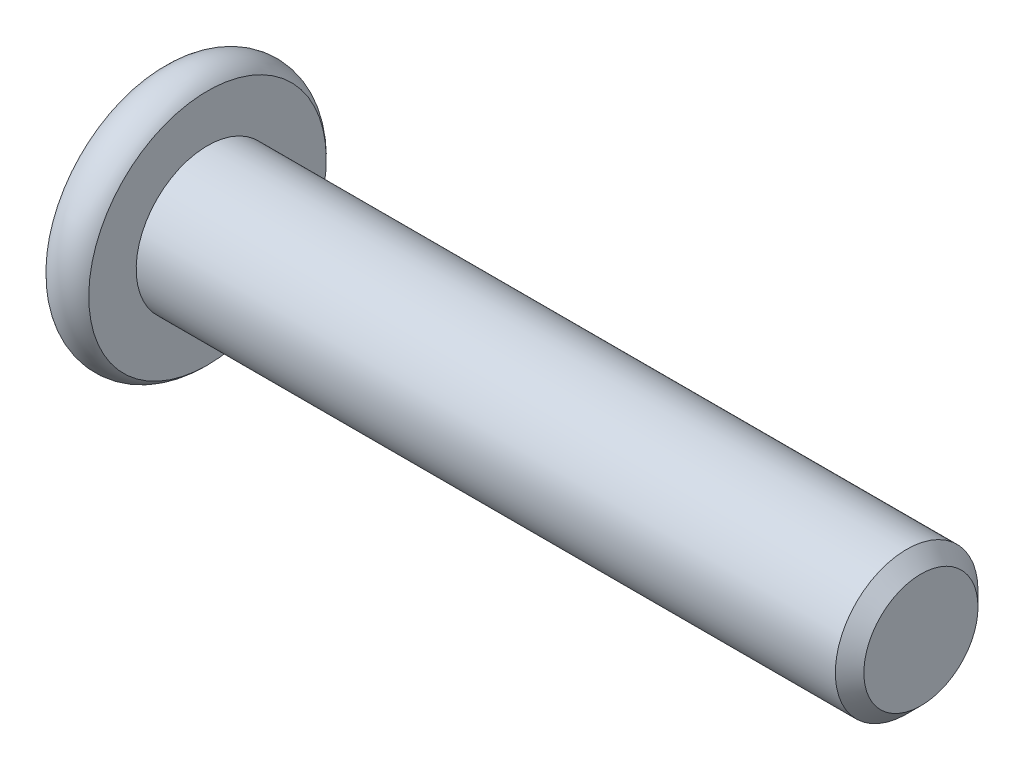
ISO-10303-21;
HEADER;
FILE_DESCRIPTION(('STEP AP214'),'2;1');
FILE_NAME('part.step','',(''),(''),'','','');
FILE_SCHEMA(('AUTOMOTIVE_DESIGN { 1 0 10303 214 1 1 1 1 }'));
ENDSEC;
DATA;
#1=APPLICATION_CONTEXT('core data for automotive mechanical design processes');
#2=APPLICATION_PROTOCOL_DEFINITION('international standard','automotive_design',2000,#1);
#3=PRODUCT_CONTEXT('',#1,'mechanical');
#4=PRODUCT('Part','Part','',(#3));
#5=PRODUCT_RELATED_PRODUCT_CATEGORY('part','',(#4));
#6=PRODUCT_DEFINITION_FORMATION('','',#4);
#7=PRODUCT_DEFINITION_CONTEXT('part definition',#1,'design');
#8=PRODUCT_DEFINITION('design','',#6,#7);
#9=PRODUCT_DEFINITION_SHAPE('','',#8);
#10=(LENGTH_UNIT() NAMED_UNIT(*) SI_UNIT(.MILLI.,.METRE.));
#11=(NAMED_UNIT(*) PLANE_ANGLE_UNIT() SI_UNIT($,.RADIAN.));
#12=(NAMED_UNIT(*) SI_UNIT($,.STERADIAN.) SOLID_ANGLE_UNIT());
#13=UNCERTAINTY_MEASURE_WITH_UNIT(LENGTH_MEASURE(1.E-05),#10,'distance_accuracy_value','');
#14=(GEOMETRIC_REPRESENTATION_CONTEXT(3) GLOBAL_UNCERTAINTY_ASSIGNED_CONTEXT((#13)) GLOBAL_UNIT_ASSIGNED_CONTEXT((#10,
#11,#12)) REPRESENTATION_CONTEXT('',''));
#15=CARTESIAN_POINT('',(0.,0.,0.));
#16=DIRECTION('',(0.,0.,1.));
#17=DIRECTION('',(1.,0.,0.));
#18=AXIS2_PLACEMENT_3D('',#15,#16,#17);
#19=CARTESIAN_POINT('',(-25.,0.,0.));
#20=DIRECTION('',(1.,0.,0.));
#21=DIRECTION('',(0.,0.,-1.));
#22=AXIS2_PLACEMENT_3D('',#19,#20,#21);
#23=CYLINDRICAL_SURFACE('',#22,2.5);
#24=CARTESIAN_POINT('',(-0.500000000000004,0.,0.));
#25=DIRECTION('',(1.,0.,0.));
#26=DIRECTION('',(0.,0.,-1.));
#27=AXIS2_PLACEMENT_3D('',#24,#25,#26);
#28=CIRCLE('',#27,2.5);
#29=CARTESIAN_POINT('',(-0.500000000000004,0.,-2.5));
#30=VERTEX_POINT('',#29);
#31=EDGE_CURVE('E49',#30,#30,#28,.F.);
#32=ORIENTED_EDGE('',*,*,#31,.T.);
#33=EDGE_LOOP('',(#32));
#34=FACE_BOUND('',#33,.T.);
#35=CARTESIAN_POINT('',(-25.,0.,0.));
#36=DIRECTION('',(-1.,0.,0.));
#37=DIRECTION('',(0.,-1.,0.));
#38=AXIS2_PLACEMENT_3D('',#35,#36,#37);
#39=CIRCLE('',#38,2.5);
#40=CARTESIAN_POINT('',(-25.,-2.50000000000001,0.));
#41=VERTEX_POINT('',#40);
#42=EDGE_CURVE('E134',#41,#41,#39,.F.);
#43=ORIENTED_EDGE('',*,*,#42,.T.);
#44=EDGE_LOOP('',(#43));
#45=FACE_BOUND('',#44,.T.);
#46=ADVANCED_FACE('F35',(#34,#45),#23,.T.);
#47=CARTESIAN_POINT('',(0.,0.,0.));
#48=DIRECTION('',(1.,0.,0.));
#49=DIRECTION('',(0.,0.,-1.));
#50=AXIS2_PLACEMENT_3D('',#47,#48,#49);
#51=PLANE('',#50);
#52=CARTESIAN_POINT('',(0.,0.,0.));
#53=DIRECTION('',(1.,0.,0.));
#54=DIRECTION('',(0.,0.,-1.));
#55=AXIS2_PLACEMENT_3D('',#52,#53,#54);
#56=CIRCLE('',#55,1.99999999999999);
#57=CARTESIAN_POINT('',(0.,0.,-1.99999999999999));
#58=VERTEX_POINT('',#57);
#59=EDGE_CURVE('E138',#58,#58,#56,.T.);
#60=ORIENTED_EDGE('',*,*,#59,.T.);
#61=EDGE_LOOP('',(#60));
#62=FACE_BOUND('',#61,.T.);
#63=ADVANCED_FACE('F152',(#62),#51,.T.);
#64=CARTESIAN_POINT('',(0.,0.,0.));
#65=DIRECTION('',(-1.,0.,0.));
#66=DIRECTION('',(0.,0.,1.));
#67=AXIS2_PLACEMENT_3D('',#64,#65,#66);
#68=CONICAL_SURFACE('',#67,1.99999999999999,0.785398163397447);
#69=ORIENTED_EDGE('',*,*,#31,.F.);
#70=EDGE_LOOP('',(#69));
#71=FACE_BOUND('',#70,.T.);
#72=ORIENTED_EDGE('',*,*,#59,.F.);
#73=EDGE_LOOP('',(#72));
#74=FACE_BOUND('',#73,.T.);
#75=ADVANCED_FACE('F37',(#71,#74),#68,.T.);
#76=CARTESIAN_POINT('',(-26.5,0.,0.));
#77=DIRECTION('',(1.,0.,0.));
#78=DIRECTION('',(0.,1.,0.));
#79=AXIS2_PLACEMENT_3D('',#76,#77,#78);
#80=PLANE('',#79);
#81=CARTESIAN_POINT('',(-26.5,1.01169842360595E-13,0.));
#82=DIRECTION('',(-1.,0.,0.));
#83=DIRECTION('',(0.,-1.,0.));
#84=AXIS2_PLACEMENT_3D('',#81,#82,#83);
#85=CIRCLE('',#84,1.78205080756885);
#86=CARTESIAN_POINT('',(-26.5,-1.78205080756875,0.));
#87=VERTEX_POINT('',#86);
#88=EDGE_CURVE('E374',#87,#87,#85,.T.);
#89=ORIENTED_EDGE('',*,*,#88,.F.);
#90=EDGE_LOOP('',(#89));
#91=FACE_BOUND('',#90,.T.);
#92=CARTESIAN_POINT('',(-26.5,0.,0.));
#93=DIRECTION('',(-1.,0.,0.));
#94=DIRECTION('',(0.,-1.,0.));
#95=AXIS2_PLACEMENT_3D('',#92,#93,#94);
#96=CIRCLE('',#95,4.16143782776614);
#97=CARTESIAN_POINT('',(-26.5,-4.16143782776615,0.));
#98=VERTEX_POINT('',#97);
#99=EDGE_CURVE('E130',#98,#98,#96,.T.);
#100=ORIENTED_EDGE('',*,*,#99,.T.);
#101=EDGE_LOOP('',(#100));
#102=FACE_BOUND('',#101,.T.);
#103=ADVANCED_FACE('F151',(#91,#102),#80,.F.);
#104=CARTESIAN_POINT('',(-25.75,0.,0.));
#105=DIRECTION('',(-1.,0.,0.));
#106=DIRECTION('',(0.,-1.,0.));
#107=AXIS2_PLACEMENT_3D('',#104,#105,#106);
#108=TOROIDAL_SURFACE('',#107,3.5,1.);
#109=ORIENTED_EDGE('',*,*,#99,.F.);
#110=EDGE_LOOP('',(#109));
#111=FACE_BOUND('',#110,.T.);
#112=CARTESIAN_POINT('',(-25.,0.,0.));
#113=DIRECTION('',(-1.,0.,0.));
#114=DIRECTION('',(0.,-1.,0.));
#115=AXIS2_PLACEMENT_3D('',#112,#113,#114);
#116=CIRCLE('',#115,4.16143782776614);
#117=CARTESIAN_POINT('',(-25.,-4.16143782776615,0.));
#118=VERTEX_POINT('',#117);
#119=EDGE_CURVE('E126',#118,#118,#116,.T.);
#120=ORIENTED_EDGE('',*,*,#119,.T.);
#121=EDGE_LOOP('',(#120));
#122=FACE_BOUND('',#121,.T.);
#123=ADVANCED_FACE('F163',(#111,#122),#108,.T.);
#124=CARTESIAN_POINT('',(-25.,4.16143782776614,0.));
#125=DIRECTION('',(-1.,0.,0.));
#126=DIRECTION('',(0.,-1.,0.));
#127=AXIS2_PLACEMENT_3D('',#124,#125,#126);
#128=PLANE('',#127);
#129=ORIENTED_EDGE('',*,*,#42,.F.);
#130=EDGE_LOOP('',(#129));
#131=FACE_BOUND('',#130,.T.);
#132=ORIENTED_EDGE('',*,*,#119,.F.);
#133=EDGE_LOOP('',(#132));
#134=FACE_BOUND('',#133,.T.);
#135=ADVANCED_FACE('F167',(#131,#134),#128,.F.);
#136=CARTESIAN_POINT('',(-26.5,1.01169842360595E-13,0.));
#137=DIRECTION('',(-1.,0.,0.));
#138=DIRECTION('',(0.,-1.,0.));
#139=AXIS2_PLACEMENT_3D('',#136,#137,#138);
#140=CONICAL_SURFACE('',#139,1.78205080756885,0.78539816339745);
#141=ORIENTED_EDGE('',*,*,#88,.T.);
#142=EDGE_LOOP('',(#141));
#143=FACE_BOUND('',#142,.T.);
#144=CARTESIAN_POINT('',(-27.015428085613,-1.74023253176571,1.5));
#145=CARTESIAN_POINT('',(-26.9833811073445,-1.69791724929724,1.5));
#146=CARTESIAN_POINT('',(-26.9516444672841,-1.65536760966785,1.5));
#147=CARTESIAN_POINT('',(-26.8889203936153,-1.56970398156678,1.5));
#148=CARTESIAN_POINT('',(-26.85793314822,-1.52658985542842,1.5));
#149=CARTESIAN_POINT('',(-26.765846164345,-1.39562626326557,1.5));
#150=CARTESIAN_POINT('',(-26.7061145123021,-1.30679868010569,1.5));
#151=CARTESIAN_POINT('',(-26.5887342891013,-1.12044622640208,1.5));
#152=CARTESIAN_POINT('',(-26.5314082774823,-1.02271587306666,1.5));
#153=CARTESIAN_POINT('',(-26.426463214976,-0.822357214965194,1.5));
#154=CARTESIAN_POINT('',(-26.3788114236896,-0.719746931701858,1.5));
#155=CARTESIAN_POINT('',(-26.3205099883151,-0.565852387095032,1.5));
#156=CARTESIAN_POINT('',(-26.3037990535409,-0.51687419142462,1.5));
#157=CARTESIAN_POINT('',(-26.2743077515089,-0.417723988457459,1.5));
#158=CARTESIAN_POINT('',(-26.2615276514219,-0.367551900263826,1.5));
#159=CARTESIAN_POINT('',(-26.2407784202458,-0.267158299056077,1.5));
#160=CARTESIAN_POINT('',(-26.232726061826,-0.216954261864813,1.5));
#161=CARTESIAN_POINT('',(-26.221591636834,-0.115994915871279,1.5));
#162=CARTESIAN_POINT('',(-26.2185086886377,-0.0652397064614969,1.5));
#163=CARTESIAN_POINT('',(-26.2175473897404,0.034422223487599,1.5));
#164=CARTESIAN_POINT('',(-26.2194789216952,0.0833271701101331,1.5));
#165=CARTESIAN_POINT('',(-26.2280175729677,0.180724293127266,1.5));
#166=CARTESIAN_POINT('',(-26.234625142048,0.229216429361773,1.5));
#167=CARTESIAN_POINT('',(-26.2522650626447,0.326258027697052,1.5));
#168=CARTESIAN_POINT('',(-26.263373168201,0.374793507450073,1.5));
#169=CARTESIAN_POINT('',(-26.2894198669595,0.470802295834227,1.5));
#170=CARTESIAN_POINT('',(-26.3043581560035,0.51827568848133,1.5));
#171=CARTESIAN_POINT('',(-26.356839545716,0.667150562065179,1.5));
#172=CARTESIAN_POINT('',(-26.4003351165442,0.766448362426898,1.5));
#173=CARTESIAN_POINT('',(-26.4970587814836,0.960384405673885,1.5));
#174=CARTESIAN_POINT('',(-26.5503217226675,1.05500437383626,1.5));
#175=CARTESIAN_POINT('',(-26.6602258010454,1.23584520321537,1.5));
#176=CARTESIAN_POINT('',(-26.7165682531046,1.32224986946555,1.5));
#177=CARTESIAN_POINT('',(-26.803675572597,1.44954953726478,1.5));
#178=CARTESIAN_POINT('',(-26.8330199906839,1.49143368482428,1.5));
#179=CARTESIAN_POINT('',(-26.8924869182931,1.57462914783249,1.5));
#180=CARTESIAN_POINT('',(-26.9226092115007,1.61594061772584,1.5));
#181=CARTESIAN_POINT('',(-26.9530541181366,1.65701358742558,1.5));
#182=B_SPLINE_CURVE_WITH_KNOTS('',3,(#144,#145,#146,#147,#148,#149,#150,#151,#152,#153,#154,
#155,#156,#157,#158,#159,#160,#161,#162,#163,#164,#165,#166,#167,#168,#169,#170,#171,#172,#173,
#174,#175,#176,#177,#178,#179,#180,#181),.UNSPECIFIED.,.F.,.F.,(4,2,2,2,2,2,2,2,2,2,2,2,2,2,2,2,
2,2,4),(0.,0.159238974218355,0.318517535014544,0.639504781932387,0.979137893799194,
1.31760168934356,1.47272233841623,1.62785352839775,1.78016486537346,1.93244917778278,
2.07904486260297,2.22565464958331,2.37484213303398,2.52401777304039,2.84828365283774,
3.17372975666749,3.48303030530536,3.63644667013907,3.78982082222911),.UNSPECIFIED.);
#183=CARTESIAN_POINT('',(-26.45,-0.866025403784338,1.5));
#184=VERTEX_POINT('',#183);
#185=CARTESIAN_POINT('',(-26.45,0.86602540378454,1.5));
#186=VERTEX_POINT('',#185);
#187=EDGE_CURVE('E104',#184,#186,#182,.T.);
#188=ORIENTED_EDGE('',*,*,#187,.F.);
#189=CARTESIAN_POINT('',(-26.4501154816001,-1.73216627762261,-0.000200000000000525));
#190=CARTESIAN_POINT('',(-26.4203654760674,-1.70239359975905,0.0513677907370755));
#191=CARTESIAN_POINT('',(-26.3923624839104,-1.67212305186345,0.103797917665201));
#192=CARTESIAN_POINT('',(-26.3410892304402,-1.61039789003609,0.210709034055597));
#193=CARTESIAN_POINT('',(-26.3178475050444,-1.57893740312604,0.265200195814661));
#194=CARTESIAN_POINT('',(-26.2780337289923,-1.51549879897977,0.375079081357248));
#195=CARTESIAN_POINT('',(-26.2613615856709,-1.483536845268,0.430438809095199));
#196=CARTESIAN_POINT('',(-26.2356744568181,-1.41890915196201,0.54237725747715));
#197=CARTESIAN_POINT('',(-26.2266402904789,-1.38624538781108,0.598952556553008));
#198=CARTESIAN_POINT('',(-26.2184890812269,-1.32995210095289,0.69645538951644));
#199=CARTESIAN_POINT('',(-26.2172822529893,-1.30639533311114,0.737256908280466));
#200=CARTESIAN_POINT('',(-26.2193140571623,-1.25932335290183,0.818787969615858));
#201=CARTESIAN_POINT('',(-26.2225536707483,-1.23580815085303,0.859517494314629));
#202=CARTESIAN_POINT('',(-26.233291985982,-1.18900414978417,0.940584402163415));
#203=CARTESIAN_POINT('',(-26.2407946530188,-1.1657155821171,0.980921384598287));
#204=CARTESIAN_POINT('',(-26.2596516119283,-1.11952932016325,1.06091833691403));
#205=CARTESIAN_POINT('',(-26.2710075570186,-1.09663179808776,1.10057800851621));
#206=CARTESIAN_POINT('',(-26.3047216475927,-1.03798159809688,1.20216313477448));
#207=CARTESIAN_POINT('',(-26.3296218490934,-1.00259267147455,1.26345855370969));
#208=CARTESIAN_POINT('',(-26.3716566532716,-0.950557780604275,1.35358562846331));
#209=CARTESIAN_POINT('',(-26.3864251535591,-0.933410759677048,1.38328513990772));
#210=CARTESIAN_POINT('',(-26.4173105659402,-0.899432101996308,1.44213790138375));
#211=CARTESIAN_POINT('',(-26.4334268341217,-0.88260031928561,1.47129140422064));
#212=CARTESIAN_POINT('',(-26.4501154816001,-0.865909933730501,1.5002));
#213=B_SPLINE_CURVE_WITH_KNOTS('',3,(#189,#190,#191,#192,#193,#194,#195,#196,#197,#198,#199,
#200,#201,#202,#203,#204,#205,#206,#207,#208,#209,#210,#211,#212),.UNSPECIFIED.,.F.,.F.,(4,2,2,
2,2,2,2,2,2,2,2,4),(0.,0.199829143693305,0.400822987382387,0.59862372053818,0.795926240188888,
0.93711306795988,1.07833105577193,1.21968061668222,1.36109089931054,1.58570969637565,
1.69770705470963,1.80965120737193),.UNSPECIFIED.);
#214=CARTESIAN_POINT('',(-26.45,-1.73205080756878,0.));
#215=VERTEX_POINT('',#214);
#216=EDGE_CURVE('E209',#215,#184,#213,.T.);
#217=ORIENTED_EDGE('',*,*,#216,.F.);
#218=CARTESIAN_POINT('',(-26.4501154816001,-0.865909933730499,-1.5002));
#219=CARTESIAN_POINT('',(-26.4203654760674,-0.895682611594064,-1.44863220926293));
#220=CARTESIAN_POINT('',(-26.3923624839103,-0.925953159489663,-1.3962020823348));
#221=CARTESIAN_POINT('',(-26.3410892304402,-0.987678321317022,-1.2892909659444));
#222=CARTESIAN_POINT('',(-26.3178475050444,-1.01913880822707,-1.23479980418534));
#223=CARTESIAN_POINT('',(-26.2780337289923,-1.08257741237334,-1.12492091864275));
#224=CARTESIAN_POINT('',(-26.2613615856709,-1.11453936608511,-1.0695611909048));
#225=CARTESIAN_POINT('',(-26.2356744568181,-1.1791670593911,-0.957622742522849));
#226=CARTESIAN_POINT('',(-26.2266402904789,-1.21183082354203,-0.90104744344699));
#227=CARTESIAN_POINT('',(-26.2184890812269,-1.26812411040022,-0.803544610483558));
#228=CARTESIAN_POINT('',(-26.2172822529893,-1.29168087824198,-0.762743091719532));
#229=CARTESIAN_POINT('',(-26.2193140571623,-1.33875285845128,-0.68121203038414));
#230=CARTESIAN_POINT('',(-26.2225536707483,-1.36226806050008,-0.640482505685369));
#231=CARTESIAN_POINT('',(-26.233291985982,-1.40907206156895,-0.559415597836583));
#232=CARTESIAN_POINT('',(-26.2407946530188,-1.43236062923602,-0.519078615401711));
#233=CARTESIAN_POINT('',(-26.2596516119283,-1.47854689118986,-0.439081663085968));
#234=CARTESIAN_POINT('',(-26.2710075570186,-1.50144441326535,-0.39942199148379));
#235=CARTESIAN_POINT('',(-26.3047216475927,-1.56009461325623,-0.297836865225514));
#236=CARTESIAN_POINT('',(-26.3296218490934,-1.59548353987856,-0.23654144629031));
#237=CARTESIAN_POINT('',(-26.3716566532716,-1.64751843074884,-0.146414371536687));
#238=CARTESIAN_POINT('',(-26.3864251535591,-1.66466545167607,-0.116714860092283));
#239=CARTESIAN_POINT('',(-26.4173105659402,-1.69864410935681,-0.0578620986162499));
#240=CARTESIAN_POINT('',(-26.4334268341217,-1.7154758920675,-0.0287085957793639));
#241=CARTESIAN_POINT('',(-26.4501154816001,-1.73216627762261,0.000199999999998611));
#242=B_SPLINE_CURVE_WITH_KNOTS('',3,(#218,#219,#220,#221,#222,#223,#224,#225,#226,#227,#228,
#229,#230,#231,#232,#233,#234,#235,#236,#237,#238,#239,#240,#241),.UNSPECIFIED.,.F.,.F.,(4,2,2,
2,2,2,2,2,2,2,2,4),(0.,0.199829143693305,0.40082298738239,0.598623720538183,0.795926240188893,
0.937113067959885,1.07833105577193,1.21968061668222,1.36109089931055,1.58570969637566,
1.69770705470964,1.80965120737194),.UNSPECIFIED.);
#243=CARTESIAN_POINT('',(-26.45,-0.866025403784338,-1.5));
#244=VERTEX_POINT('',#243);
#245=EDGE_CURVE('E204',#244,#215,#242,.T.);
#246=ORIENTED_EDGE('',*,*,#245,.F.);
#247=CARTESIAN_POINT('',(-27.015428085613,-1.7402325317657,-1.5));
#248=CARTESIAN_POINT('',(-26.9833811073445,-1.69791724929724,-1.5));
#249=CARTESIAN_POINT('',(-26.9516444672841,-1.65536760966785,-1.5));
#250=CARTESIAN_POINT('',(-26.8889203936153,-1.56970398156678,-1.5));
#251=CARTESIAN_POINT('',(-26.85793314822,-1.52658985542842,-1.5));
#252=CARTESIAN_POINT('',(-26.765846164345,-1.39562626326556,-1.5));
#253=CARTESIAN_POINT('',(-26.7061145123021,-1.30679868010569,-1.5));
#254=CARTESIAN_POINT('',(-26.5887342891013,-1.12044622640208,-1.5));
#255=CARTESIAN_POINT('',(-26.5314082774823,-1.02271587306666,-1.5));
#256=CARTESIAN_POINT('',(-26.426463214976,-0.822357214965194,-1.5));
#257=CARTESIAN_POINT('',(-26.3788114236896,-0.719746931701856,-1.5));
#258=CARTESIAN_POINT('',(-26.3205099883151,-0.56585238709503,-1.5));
#259=CARTESIAN_POINT('',(-26.3037990535409,-0.516874191424619,-1.5));
#260=CARTESIAN_POINT('',(-26.2743077515089,-0.417723988457458,-1.5));
#261=CARTESIAN_POINT('',(-26.2615276514219,-0.367551900263825,-1.5));
#262=CARTESIAN_POINT('',(-26.2407784202458,-0.267158299056076,-1.5));
#263=CARTESIAN_POINT('',(-26.232726061826,-0.216954261864812,-1.5));
#264=CARTESIAN_POINT('',(-26.221591636834,-0.115994915871278,-1.5));
#265=CARTESIAN_POINT('',(-26.2185086886377,-0.0652397064614956,-1.5));
#266=CARTESIAN_POINT('',(-26.2175473897404,0.0344222234876,-1.5));
#267=CARTESIAN_POINT('',(-26.2194789216952,0.083327170110134,-1.5));
#268=CARTESIAN_POINT('',(-26.2280175729677,0.180724293127267,-1.5));
#269=CARTESIAN_POINT('',(-26.234625142048,0.229216429361774,-1.5));
#270=CARTESIAN_POINT('',(-26.2522650626447,0.326258027697053,-1.5));
#271=CARTESIAN_POINT('',(-26.263373168201,0.374793507450073,-1.5));
#272=CARTESIAN_POINT('',(-26.2894198669595,0.470802295834227,-1.5));
#273=CARTESIAN_POINT('',(-26.3043581560035,0.51827568848133,-1.5));
#274=CARTESIAN_POINT('',(-26.356839545716,0.66715056206518,-1.5));
#275=CARTESIAN_POINT('',(-26.4003351165442,0.766448362426899,-1.5));
#276=CARTESIAN_POINT('',(-26.4970587814836,0.960384405673885,-1.5));
#277=CARTESIAN_POINT('',(-26.5503217226675,1.05500437383626,-1.5));
#278=CARTESIAN_POINT('',(-26.6602258010454,1.23584520321537,-1.5));
#279=CARTESIAN_POINT('',(-26.7165682531046,1.32224986946555,-1.5));
#280=CARTESIAN_POINT('',(-26.803675572597,1.44954953726478,-1.5));
#281=CARTESIAN_POINT('',(-26.8330199906839,1.49143368482428,-1.5));
#282=CARTESIAN_POINT('',(-26.8924869182931,1.57462914783249,-1.5));
#283=CARTESIAN_POINT('',(-26.9226092115007,1.61594061772585,-1.5));
#284=CARTESIAN_POINT('',(-26.9530541181366,1.65701358742558,-1.5));
#285=B_SPLINE_CURVE_WITH_KNOTS('',3,(#247,#248,#249,#250,#251,#252,#253,#254,#255,#256,#257,
#258,#259,#260,#261,#262,#263,#264,#265,#266,#267,#268,#269,#270,#271,#272,#273,#274,#275,#276,
#277,#278,#279,#280,#281,#282,#283,#284),.UNSPECIFIED.,.F.,.F.,(4,2,2,2,2,2,2,2,2,2,2,2,2,2,2,2,
2,2,4),(0.,0.159238974218352,0.318517535014541,0.639504781932383,0.979137893799189,
1.31760168934356,1.47272233841623,1.62785352839774,1.78016486537345,1.93244917778278,
2.07904486260296,2.22565464958331,2.37484213303397,2.52401777304038,2.84828365283774,
3.17372975666748,3.48303030530535,3.63644667013907,3.78982082222911),.UNSPECIFIED.);
#286=CARTESIAN_POINT('',(-26.45,0.86602540378454,-1.5));
#287=VERTEX_POINT('',#286);
#288=EDGE_CURVE('E56',#287,#244,#285,.F.);
#289=ORIENTED_EDGE('',*,*,#288,.F.);
#290=CARTESIAN_POINT('',(-26.4501154816001,1.73216627762282,0.000200000000000487));
#291=CARTESIAN_POINT('',(-26.4203654760674,1.70239359975925,-0.0513677907370748));
#292=CARTESIAN_POINT('',(-26.3923624839103,1.67212305186365,-0.1037979176652));
#293=CARTESIAN_POINT('',(-26.3410892304402,1.61039789003629,-0.210709034055595));
#294=CARTESIAN_POINT('',(-26.3178475050444,1.57893740312624,-0.26520019581466));
#295=CARTESIAN_POINT('',(-26.2780337289922,1.51549879897997,-0.375079081357248));
#296=CARTESIAN_POINT('',(-26.2613615856709,1.4835368452682,-0.4304388090952));
#297=CARTESIAN_POINT('',(-26.2356744568181,1.41890915196221,-0.542377257477151));
#298=CARTESIAN_POINT('',(-26.2266402904789,1.38624538781128,-0.598952556553009));
#299=CARTESIAN_POINT('',(-26.2184890812269,1.3299521009531,-0.696455389516441));
#300=CARTESIAN_POINT('',(-26.2172822529892,1.30639533311134,-0.737256908280466));
#301=CARTESIAN_POINT('',(-26.2193140571623,1.25932335290203,-0.818787969615858));
#302=CARTESIAN_POINT('',(-26.2225536707483,1.23580815085323,-0.85951749431463));
#303=CARTESIAN_POINT('',(-26.233291985982,1.18900414978437,-0.940584402163416));
#304=CARTESIAN_POINT('',(-26.2407946530188,1.1657155821173,-0.980921384598289));
#305=CARTESIAN_POINT('',(-26.2596516119283,1.11952932016345,-1.06091833691403));
#306=CARTESIAN_POINT('',(-26.2710075570186,1.09663179808796,-1.10057800851621));
#307=CARTESIAN_POINT('',(-26.3047216475927,1.03798159809708,-1.20216313477449));
#308=CARTESIAN_POINT('',(-26.3296218490934,1.00259267147475,-1.26345855370969));
#309=CARTESIAN_POINT('',(-26.3716566532716,0.950557780604475,-1.35358562846331));
#310=CARTESIAN_POINT('',(-26.3864251535591,0.933410759677248,-1.38328513990772));
#311=CARTESIAN_POINT('',(-26.4173105659402,0.899432101996507,-1.44213790138375));
#312=CARTESIAN_POINT('',(-26.4334268341217,0.882600319285811,-1.47129140422064));
#313=CARTESIAN_POINT('',(-26.4501154816001,0.865909933730702,-1.5002));
#314=B_SPLINE_CURVE_WITH_KNOTS('',3,(#290,#291,#292,#293,#294,#295,#296,#297,#298,#299,#300,
#301,#302,#303,#304,#305,#306,#307,#308,#309,#310,#311,#312,#313),.UNSPECIFIED.,.F.,.F.,(4,2,2,
2,2,2,2,2,2,2,2,4),(0.,0.199829143693305,0.400822987382389,0.598623720538183,0.79592624018889,
0.937113067959883,1.07833105577193,1.21968061668222,1.36109089931055,1.58570969637566,
1.69770705470964,1.80965120737194),.UNSPECIFIED.);
#315=CARTESIAN_POINT('',(-26.45,1.73205080756898,0.));
#316=VERTEX_POINT('',#315);
#317=EDGE_CURVE('E11',#316,#287,#314,.T.);
#318=ORIENTED_EDGE('',*,*,#317,.F.);
#319=CARTESIAN_POINT('',(-26.4501154816001,0.865909933730702,1.5002));
#320=CARTESIAN_POINT('',(-26.4203654760674,0.895682611594268,1.44863220926292));
#321=CARTESIAN_POINT('',(-26.3923624839103,0.925953159489867,1.3962020823348));
#322=CARTESIAN_POINT('',(-26.3410892304402,0.987678321317225,1.2892909659444));
#323=CARTESIAN_POINT('',(-26.3178475050444,1.01913880822728,1.23479980418534));
#324=CARTESIAN_POINT('',(-26.2780337289922,1.08257741237354,1.12492091864275));
#325=CARTESIAN_POINT('',(-26.2613615856709,1.11453936608531,1.0695611909048));
#326=CARTESIAN_POINT('',(-26.2356744568181,1.1791670593913,0.95762274252285));
#327=CARTESIAN_POINT('',(-26.2266402904789,1.21183082354223,0.901047443446992));
#328=CARTESIAN_POINT('',(-26.2184890812269,1.26812411040042,0.80354461048356));
#329=CARTESIAN_POINT('',(-26.2172822529892,1.29168087824218,0.762743091719535));
#330=CARTESIAN_POINT('',(-26.2193140571623,1.33875285845148,0.681212030384143));
#331=CARTESIAN_POINT('',(-26.2225536707483,1.36226806050028,0.640482505685371));
#332=CARTESIAN_POINT('',(-26.233291985982,1.40907206156915,0.559415597836585));
#333=CARTESIAN_POINT('',(-26.2407946530188,1.43236062923622,0.519078615401713));
#334=CARTESIAN_POINT('',(-26.2596516119283,1.47854689119006,0.43908166308597));
#335=CARTESIAN_POINT('',(-26.2710075570186,1.50144441326555,0.399421991483793));
#336=CARTESIAN_POINT('',(-26.3047216475927,1.56009461325643,0.297836865225516));
#337=CARTESIAN_POINT('',(-26.3296218490934,1.59548353987876,0.236541446290312));
#338=CARTESIAN_POINT('',(-26.3716566532716,1.64751843074904,0.146414371536687));
#339=CARTESIAN_POINT('',(-26.3864251535591,1.66466545167627,0.116714860092283));
#340=CARTESIAN_POINT('',(-26.4173105659402,1.69864410935701,0.0578620986162496));
#341=CARTESIAN_POINT('',(-26.4334268341217,1.71547589206771,0.0287085957793628));
#342=CARTESIAN_POINT('',(-26.4501154816001,1.73216627762282,-0.000200000000000406));
#343=B_SPLINE_CURVE_WITH_KNOTS('',3,(#319,#320,#321,#322,#323,#324,#325,#326,#327,#328,#329,
#330,#331,#332,#333,#334,#335,#336,#337,#338,#339,#340,#341,#342),.UNSPECIFIED.,.F.,.F.,(4,2,2,
2,2,2,2,2,2,2,2,4),(0.,0.199829143693304,0.400822987382387,0.598623720538178,0.795926240188886,
0.937113067959877,1.07833105577192,1.21968061668222,1.36109089931054,1.58570969637565,
1.69770705470963,1.80965120737194),.UNSPECIFIED.);
#344=EDGE_CURVE('E94',#186,#316,#343,.T.);
#345=ORIENTED_EDGE('',*,*,#344,.F.);
#346=EDGE_LOOP('',(#188,#217,#246,#289,#318,#345));
#347=FACE_BOUND('',#346,.T.);
#348=ADVANCED_FACE('F93',(#143,#347),#140,.F.);
#349=CARTESIAN_POINT('',(-24.2,0.,0.));
#350=DIRECTION('',(-1.,0.,0.));
#351=DIRECTION('',(0.,-1.,0.));
#352=AXIS2_PLACEMENT_3D('',#349,#350,#351);
#353=PLANE('',#352);
#354=DIRECTION('',(0.,0.5,-0.866025403784439));
#355=VECTOR('',#354,1.);
#356=CARTESIAN_POINT('',(-24.2,0.866025403784531,1.5));
#357=LINE('',#356,#355);
#358=CARTESIAN_POINT('',(-24.2,0.866025403784531,1.5));
#359=VERTEX_POINT('',#358);
#360=CARTESIAN_POINT('',(-24.2,1.73205080756897,0.));
#361=VERTEX_POINT('',#360);
#362=EDGE_CURVE('E103',#359,#361,#357,.T.);
#363=ORIENTED_EDGE('',*,*,#362,.T.);
#364=DIRECTION('',(0.,-0.5,-0.866025403784439));
#365=VECTOR('',#364,1.);
#366=CARTESIAN_POINT('',(-24.2,1.73205080756897,0.));
#367=LINE('',#366,#365);
#368=CARTESIAN_POINT('',(-24.2,0.866025403784531,-1.5));
#369=VERTEX_POINT('',#368);
#370=EDGE_CURVE('E108',#361,#369,#367,.T.);
#371=ORIENTED_EDGE('',*,*,#370,.T.);
#372=DIRECTION('',(0.,-1.,0.));
#373=VECTOR('',#372,1.);
#374=CARTESIAN_POINT('',(-24.2,0.866025403784531,-1.5));
#375=LINE('',#374,#373);
#376=CARTESIAN_POINT('',(-24.2,-0.866025403784346,-1.5));
#377=VERTEX_POINT('',#376);
#378=EDGE_CURVE('E235',#369,#377,#375,.T.);
#379=ORIENTED_EDGE('',*,*,#378,.T.);
#380=DIRECTION('',(0.,-0.5,0.866025403784438));
#381=VECTOR('',#380,1.);
#382=CARTESIAN_POINT('',(-24.2,-0.866025403784346,-1.5));
#383=LINE('',#382,#381);
#384=CARTESIAN_POINT('',(-24.2,-1.73205080756878,0.));
#385=VERTEX_POINT('',#384);
#386=EDGE_CURVE('E240',#377,#385,#383,.T.);
#387=ORIENTED_EDGE('',*,*,#386,.T.);
#388=DIRECTION('',(0.,0.5,0.866025403784439));
#389=VECTOR('',#388,1.);
#390=CARTESIAN_POINT('',(-24.2,-1.73205080756878,0.));
#391=LINE('',#390,#389);
#392=CARTESIAN_POINT('',(-24.2,-0.866025403784347,1.5));
#393=VERTEX_POINT('',#392);
#394=EDGE_CURVE('E122',#385,#393,#391,.T.);
#395=ORIENTED_EDGE('',*,*,#394,.T.);
#396=DIRECTION('',(0.,1.,0.));
#397=VECTOR('',#396,1.);
#398=CARTESIAN_POINT('',(-24.2,-0.866025403784347,1.5));
#399=LINE('',#398,#397);
#400=EDGE_CURVE('E112',#393,#359,#399,.T.);
#401=ORIENTED_EDGE('',*,*,#400,.T.);
#402=EDGE_LOOP('',(#363,#371,#379,#387,#395,#401));
#403=FACE_BOUND('',#402,.T.);
#404=ADVANCED_FACE('F191',(#403),#353,.T.);
#405=CARTESIAN_POINT('',(-24.2,1.73205080756897,0.));
#406=DIRECTION('',(0.,0.866025403784439,-0.5));
#407=DIRECTION('',(0.,0.5,0.866025403784439));
#408=AXIS2_PLACEMENT_3D('',#405,#406,#407);
#409=PLANE('',#408);
#410=DIRECTION('',(-1.,0.,0.));
#411=VECTOR('',#410,1.);
#412=CARTESIAN_POINT('',(-24.2,1.73205080756897,0.));
#413=LINE('',#412,#411);
#414=EDGE_CURVE('E100',#361,#316,#413,.T.);
#415=ORIENTED_EDGE('',*,*,#414,.T.);
#416=ORIENTED_EDGE('',*,*,#317,.T.);
#417=DIRECTION('',(-1.,0.,0.));
#418=VECTOR('',#417,1.);
#419=CARTESIAN_POINT('',(-24.2,0.866025403784531,-1.5));
#420=LINE('',#419,#418);
#421=EDGE_CURVE('E111',#369,#287,#420,.T.);
#422=ORIENTED_EDGE('',*,*,#421,.F.);
#423=ORIENTED_EDGE('',*,*,#370,.F.);
#424=EDGE_LOOP('',(#415,#416,#422,#423));
#425=FACE_BOUND('',#424,.T.);
#426=ADVANCED_FACE('F106',(#425),#409,.F.);
#427=CARTESIAN_POINT('',(-24.2,0.866025403784531,-1.5));
#428=DIRECTION('',(0.,0.,-1.));
#429=DIRECTION('',(-1.,0.,0.));
#430=AXIS2_PLACEMENT_3D('',#427,#428,#429);
#431=PLANE('',#430);
#432=ORIENTED_EDGE('',*,*,#421,.T.);
#433=ORIENTED_EDGE('',*,*,#288,.T.);
#434=DIRECTION('',(-1.,0.,0.));
#435=VECTOR('',#434,1.);
#436=CARTESIAN_POINT('',(-24.2,-0.866025403784346,-1.5));
#437=LINE('',#436,#435);
#438=EDGE_CURVE('E118',#377,#244,#437,.T.);
#439=ORIENTED_EDGE('',*,*,#438,.F.);
#440=ORIENTED_EDGE('',*,*,#378,.F.);
#441=EDGE_LOOP('',(#432,#433,#439,#440));
#442=FACE_BOUND('',#441,.T.);
#443=ADVANCED_FACE('F224',(#442),#431,.F.);
#444=CARTESIAN_POINT('',(-24.2,-0.866025403784346,-1.5));
#445=DIRECTION('',(0.,-0.866025403784439,-0.5));
#446=DIRECTION('',(0.,0.5,-0.866025403784439));
#447=AXIS2_PLACEMENT_3D('',#444,#445,#446);
#448=PLANE('',#447);
#449=ORIENTED_EDGE('',*,*,#438,.T.);
#450=ORIENTED_EDGE('',*,*,#245,.T.);
#451=DIRECTION('',(-1.,0.,0.));
#452=VECTOR('',#451,1.);
#453=CARTESIAN_POINT('',(-24.2,-1.73205080756878,0.));
#454=LINE('',#453,#452);
#455=EDGE_CURVE('E256',#385,#215,#454,.T.);
#456=ORIENTED_EDGE('',*,*,#455,.F.);
#457=ORIENTED_EDGE('',*,*,#386,.F.);
#458=EDGE_LOOP('',(#449,#450,#456,#457));
#459=FACE_BOUND('',#458,.T.);
#460=ADVANCED_FACE('F219',(#459),#448,.F.);
#461=CARTESIAN_POINT('',(-24.2,-1.73205080756878,0.));
#462=DIRECTION('',(0.,-0.866025403784439,0.5));
#463=DIRECTION('',(0.,-0.5,-0.866025403784439));
#464=AXIS2_PLACEMENT_3D('',#461,#462,#463);
#465=PLANE('',#464);
#466=ORIENTED_EDGE('',*,*,#455,.T.);
#467=ORIENTED_EDGE('',*,*,#216,.T.);
#468=DIRECTION('',(-1.,0.,0.));
#469=VECTOR('',#468,1.);
#470=CARTESIAN_POINT('',(-24.2,-0.866025403784347,1.5));
#471=LINE('',#470,#469);
#472=EDGE_CURVE('E253',#393,#184,#471,.T.);
#473=ORIENTED_EDGE('',*,*,#472,.F.);
#474=ORIENTED_EDGE('',*,*,#394,.F.);
#475=EDGE_LOOP('',(#466,#467,#473,#474));
#476=FACE_BOUND('',#475,.T.);
#477=ADVANCED_FACE('F216',(#476),#465,.F.);
#478=CARTESIAN_POINT('',(-24.2,-0.866025403784347,1.5));
#479=DIRECTION('',(0.,0.,1.));
#480=DIRECTION('',(1.,0.,0.));
#481=AXIS2_PLACEMENT_3D('',#478,#479,#480);
#482=PLANE('',#481);
#483=ORIENTED_EDGE('',*,*,#472,.T.);
#484=ORIENTED_EDGE('',*,*,#187,.T.);
#485=DIRECTION('',(-1.,0.,0.));
#486=VECTOR('',#485,1.);
#487=CARTESIAN_POINT('',(-24.2,0.866025403784531,1.5));
#488=LINE('',#487,#486);
#489=EDGE_CURVE('E63',#359,#186,#488,.T.);
#490=ORIENTED_EDGE('',*,*,#489,.F.);
#491=ORIENTED_EDGE('',*,*,#400,.F.);
#492=EDGE_LOOP('',(#483,#484,#490,#491));
#493=FACE_BOUND('',#492,.T.);
#494=ADVANCED_FACE('F174',(#493),#482,.F.);
#495=CARTESIAN_POINT('',(-24.2,0.866025403784531,1.5));
#496=DIRECTION('',(0.,0.866025403784439,0.5));
#497=DIRECTION('',(0.,-0.5,0.866025403784438));
#498=AXIS2_PLACEMENT_3D('',#495,#496,#497);
#499=PLANE('',#498);
#500=ORIENTED_EDGE('',*,*,#489,.T.);
#501=ORIENTED_EDGE('',*,*,#344,.T.);
#502=ORIENTED_EDGE('',*,*,#414,.F.);
#503=ORIENTED_EDGE('',*,*,#362,.F.);
#504=EDGE_LOOP('',(#500,#501,#502,#503));
#505=FACE_BOUND('',#504,.T.);
#506=ADVANCED_FACE('F99',(#505),#499,.F.);
#507=CLOSED_SHELL('',(#46,#63,#75,#103,#123,#135,#348,#404,#426,#443,#460,#477,#494,#506));
#508=MANIFOLD_SOLID_BREP('B2',#507);
#509=ADVANCED_BREP_SHAPE_REPRESENTATION('',(#18,#508),#14);
#510=SHAPE_DEFINITION_REPRESENTATION(#9,#509);
ENDSEC;
END-ISO-10303-21;
